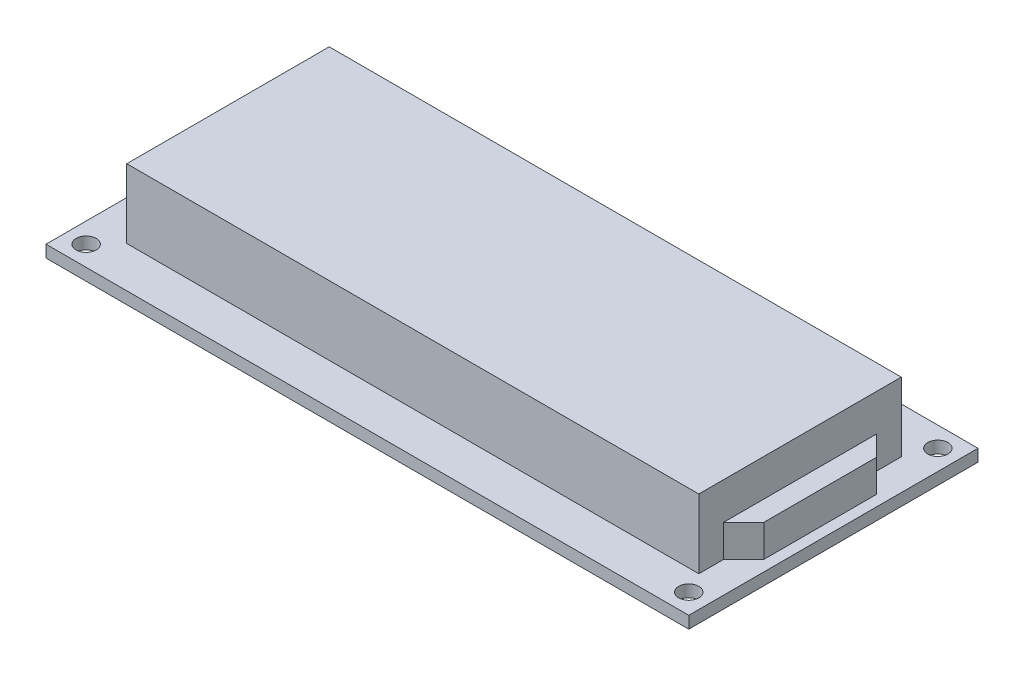
ISO-10303-21;
HEADER;
FILE_DESCRIPTION(('STEP AP214'),'2;1');
FILE_NAME('part.step','',(''),(''),'','','');
FILE_SCHEMA(('AUTOMOTIVE_DESIGN { 1 0 10303 214 1 1 1 1 }'));
ENDSEC;
DATA;
#1=APPLICATION_CONTEXT('core data for automotive mechanical design processes');
#2=APPLICATION_PROTOCOL_DEFINITION('international standard','automotive_design',2000,#1);
#3=PRODUCT_CONTEXT('',#1,'mechanical');
#4=PRODUCT('Part','Part','',(#3));
#5=PRODUCT_RELATED_PRODUCT_CATEGORY('part','',(#4));
#6=PRODUCT_DEFINITION_FORMATION('','',#4);
#7=PRODUCT_DEFINITION_CONTEXT('part definition',#1,'design');
#8=PRODUCT_DEFINITION('design','',#6,#7);
#9=PRODUCT_DEFINITION_SHAPE('','',#8);
#10=(LENGTH_UNIT() NAMED_UNIT(*) SI_UNIT(.MILLI.,.METRE.));
#11=(NAMED_UNIT(*) PLANE_ANGLE_UNIT() SI_UNIT($,.RADIAN.));
#12=(NAMED_UNIT(*) SI_UNIT($,.STERADIAN.) SOLID_ANGLE_UNIT());
#13=UNCERTAINTY_MEASURE_WITH_UNIT(LENGTH_MEASURE(1.E-05),#10,'distance_accuracy_value','');
#14=(GEOMETRIC_REPRESENTATION_CONTEXT(3) GLOBAL_UNCERTAINTY_ASSIGNED_CONTEXT((#13)) GLOBAL_UNIT_ASSIGNED_CONTEXT((#10,
#11,#12)) REPRESENTATION_CONTEXT('',''));
#15=CARTESIAN_POINT('',(0.,0.,0.));
#16=DIRECTION('',(0.,0.,1.));
#17=DIRECTION('',(1.,0.,0.));
#18=AXIS2_PLACEMENT_3D('',#15,#16,#17);
#19=CARTESIAN_POINT('',(0.,0.,0.));
#20=DIRECTION('',(0.,1.,0.));
#21=DIRECTION('',(0.,0.,1.));
#22=AXIS2_PLACEMENT_3D('',#19,#20,#21);
#23=PLANE('',#22);
#24=DIRECTION('',(0.,0.,1.));
#25=VECTOR('',#24,1.);
#26=CARTESIAN_POINT('',(-40.,0.,18.));
#27=LINE('',#26,#25);
#28=CARTESIAN_POINT('',(-40.,0.,-18.));
#29=VERTEX_POINT('',#28);
#30=CARTESIAN_POINT('',(-40.,0.,18.));
#31=VERTEX_POINT('',#30);
#32=EDGE_CURVE('E264',#29,#31,#27,.T.);
#33=ORIENTED_EDGE('',*,*,#32,.F.);
#34=DIRECTION('',(-1.,0.,0.));
#35=VECTOR('',#34,1.);
#36=CARTESIAN_POINT('',(40.,0.,-18.));
#37=LINE('',#36,#35);
#38=CARTESIAN_POINT('',(40.,0.,-18.));
#39=VERTEX_POINT('',#38);
#40=EDGE_CURVE('E271',#39,#29,#37,.T.);
#41=ORIENTED_EDGE('',*,*,#40,.F.);
#42=DIRECTION('',(0.,0.,-1.));
#43=VECTOR('',#42,1.);
#44=CARTESIAN_POINT('',(40.,0.,18.));
#45=LINE('',#44,#43);
#46=CARTESIAN_POINT('',(40.,0.,18.));
#47=VERTEX_POINT('',#46);
#48=EDGE_CURVE('E282',#47,#39,#45,.T.);
#49=ORIENTED_EDGE('',*,*,#48,.F.);
#50=DIRECTION('',(1.,0.,0.));
#51=VECTOR('',#50,1.);
#52=CARTESIAN_POINT('',(40.,0.,18.));
#53=LINE('',#52,#51);
#54=EDGE_CURVE('E280',#31,#47,#53,.T.);
#55=ORIENTED_EDGE('',*,*,#54,.F.);
#56=EDGE_LOOP('',(#33,#41,#49,#55));
#57=FACE_BOUND('',#56,.T.);
#58=CARTESIAN_POINT('',(-37.5,0.,-15.5));
#59=DIRECTION('',(0.,1.,0.));
#60=DIRECTION('',(0.,0.,1.));
#61=AXIS2_PLACEMENT_3D('',#58,#59,#60);
#62=CIRCLE('',#61,1.25000000000001);
#63=CARTESIAN_POINT('',(-37.5,0.,-14.25));
#64=VERTEX_POINT('',#63);
#65=EDGE_CURVE('E261',#64,#64,#62,.T.);
#66=ORIENTED_EDGE('',*,*,#65,.T.);
#67=EDGE_LOOP('',(#66));
#68=FACE_BOUND('',#67,.T.);
#69=CARTESIAN_POINT('',(37.5,0.,-15.5));
#70=DIRECTION('',(0.,1.,0.));
#71=DIRECTION('',(0.,0.,1.));
#72=AXIS2_PLACEMENT_3D('',#69,#70,#71);
#73=CIRCLE('',#72,1.25);
#74=CARTESIAN_POINT('',(37.5,0.,-14.25));
#75=VERTEX_POINT('',#74);
#76=EDGE_CURVE('E255',#75,#75,#73,.T.);
#77=ORIENTED_EDGE('',*,*,#76,.T.);
#78=EDGE_LOOP('',(#77));
#79=FACE_BOUND('',#78,.T.);
#80=CARTESIAN_POINT('',(-37.5,0.,15.5));
#81=DIRECTION('',(0.,1.,0.));
#82=DIRECTION('',(0.,0.,1.));
#83=AXIS2_PLACEMENT_3D('',#80,#81,#82);
#84=CIRCLE('',#83,1.25000000000001);
#85=CARTESIAN_POINT('',(-37.5,0.,16.75));
#86=VERTEX_POINT('',#85);
#87=EDGE_CURVE('E249',#86,#86,#84,.T.);
#88=ORIENTED_EDGE('',*,*,#87,.T.);
#89=EDGE_LOOP('',(#88));
#90=FACE_BOUND('',#89,.T.);
#91=CARTESIAN_POINT('',(37.5,0.,15.5));
#92=DIRECTION('',(0.,1.,0.));
#93=DIRECTION('',(0.,0.,1.));
#94=AXIS2_PLACEMENT_3D('',#91,#92,#93);
#95=CIRCLE('',#94,1.25000000000001);
#96=CARTESIAN_POINT('',(37.5,0.,16.75));
#97=VERTEX_POINT('',#96);
#98=EDGE_CURVE('E243',#97,#97,#95,.T.);
#99=ORIENTED_EDGE('',*,*,#98,.T.);
#100=EDGE_LOOP('',(#99));
#101=FACE_BOUND('',#100,.T.);
#102=DIRECTION('',(0.,0.,-1.));
#103=VECTOR('',#102,1.);
#104=CARTESIAN_POINT('',(-33.,0.,-17.5));
#105=LINE('',#104,#103);
#106=CARTESIAN_POINT('',(-33.,0.,-14.96));
#107=VERTEX_POINT('',#106);
#108=CARTESIAN_POINT('',(-33.,0.,-17.5));
#109=VERTEX_POINT('',#108);
#110=EDGE_CURVE('E172',#107,#109,#105,.T.);
#111=ORIENTED_EDGE('',*,*,#110,.F.);
#112=DIRECTION('',(-1.,0.,0.));
#113=VECTOR('',#112,1.);
#114=CARTESIAN_POINT('',(-33.,0.,-14.96));
#115=LINE('',#114,#113);
#116=CARTESIAN_POINT('',(8.,0.,-14.96));
#117=VERTEX_POINT('',#116);
#118=EDGE_CURVE('E169',#117,#107,#115,.T.);
#119=ORIENTED_EDGE('',*,*,#118,.F.);
#120=DIRECTION('',(0.,0.,1.));
#121=VECTOR('',#120,1.);
#122=CARTESIAN_POINT('',(8.,0.,-17.5));
#123=LINE('',#122,#121);
#124=CARTESIAN_POINT('',(8.,0.,-17.5));
#125=VERTEX_POINT('',#124);
#126=EDGE_CURVE('E59',#125,#117,#123,.T.);
#127=ORIENTED_EDGE('',*,*,#126,.F.);
#128=DIRECTION('',(1.,0.,0.));
#129=VECTOR('',#128,1.);
#130=CARTESIAN_POINT('',(-33.,0.,-17.5));
#131=LINE('',#130,#129);
#132=EDGE_CURVE('E54',#109,#125,#131,.T.);
#133=ORIENTED_EDGE('',*,*,#132,.F.);
#134=EDGE_LOOP('',(#111,#119,#127,#133));
#135=FACE_BOUND('',#134,.T.);
#136=ADVANCED_FACE('F39',(#57,#68,#79,#90,#101,#135),#23,.F.);
#137=CARTESIAN_POINT('',(0.,1.5,0.));
#138=DIRECTION('',(0.,1.,0.));
#139=DIRECTION('',(0.,0.,1.));
#140=AXIS2_PLACEMENT_3D('',#137,#138,#139);
#141=PLANE('',#140);
#142=DIRECTION('',(0.707106781186548,0.,0.707106781186547));
#143=VECTOR('',#142,1.);
#144=CARTESIAN_POINT('',(22.675,1.5,-22.675));
#145=LINE('',#144,#143);
#146=CARTESIAN_POINT('',(36.15,1.5,-9.20000000000001));
#147=VERTEX_POINT('',#146);
#148=CARTESIAN_POINT('',(38.65,1.5,-6.70000000000001));
#149=VERTEX_POINT('',#148);
#150=EDGE_CURVE('E175',#147,#149,#145,.T.);
#151=ORIENTED_EDGE('',*,*,#150,.T.);
#152=DIRECTION('',(0.,0.,1.));
#153=VECTOR('',#152,1.);
#154=CARTESIAN_POINT('',(38.65,1.5,0.));
#155=LINE('',#154,#153);
#156=CARTESIAN_POINT('',(38.65,1.5,7.29999999999999));
#157=VERTEX_POINT('',#156);
#158=EDGE_CURVE('E173',#149,#157,#155,.T.);
#159=ORIENTED_EDGE('',*,*,#158,.T.);
#160=DIRECTION('',(0.707106781186548,0.,-0.707106781186547));
#161=VECTOR('',#160,1.);
#162=CARTESIAN_POINT('',(22.975,1.5,22.975));
#163=LINE('',#162,#161);
#164=CARTESIAN_POINT('',(36.15,1.5,9.79999999999999));
#165=VERTEX_POINT('',#164);
#166=EDGE_CURVE('E185',#165,#157,#163,.T.);
#167=ORIENTED_EDGE('',*,*,#166,.F.);
#168=DIRECTION('',(0.,0.,1.));
#169=VECTOR('',#168,1.);
#170=CARTESIAN_POINT('',(36.15,1.5,0.));
#171=LINE('',#170,#169);
#172=CARTESIAN_POINT('',(36.15,1.5,12.9));
#173=VERTEX_POINT('',#172);
#174=EDGE_CURVE('E226',#165,#173,#171,.T.);
#175=ORIENTED_EDGE('',*,*,#174,.T.);
#176=DIRECTION('',(1.,0.,0.));
#177=VECTOR('',#176,1.);
#178=CARTESIAN_POINT('',(0.,1.5,12.9));
#179=LINE('',#178,#177);
#180=CARTESIAN_POINT('',(-35.05,1.5,12.9));
#181=VERTEX_POINT('',#180);
#182=EDGE_CURVE('E223',#181,#173,#179,.T.);
#183=ORIENTED_EDGE('',*,*,#182,.F.);
#184=DIRECTION('',(0.,0.,1.));
#185=VECTOR('',#184,1.);
#186=CARTESIAN_POINT('',(-35.05,1.5,0.));
#187=LINE('',#186,#185);
#188=CARTESIAN_POINT('',(-35.05,1.5,-12.3));
#189=VERTEX_POINT('',#188);
#190=EDGE_CURVE('E207',#189,#181,#187,.T.);
#191=ORIENTED_EDGE('',*,*,#190,.F.);
#192=DIRECTION('',(1.,0.,0.));
#193=VECTOR('',#192,1.);
#194=CARTESIAN_POINT('',(0.,1.5,-12.3));
#195=LINE('',#194,#193);
#196=CARTESIAN_POINT('',(36.15,1.5,-12.3));
#197=VERTEX_POINT('',#196);
#198=EDGE_CURVE('E212',#189,#197,#195,.T.);
#199=ORIENTED_EDGE('',*,*,#198,.T.);
#200=EDGE_CURVE('E227',#197,#147,#171,.T.);
#201=ORIENTED_EDGE('',*,*,#200,.T.);
#202=EDGE_LOOP('',(#151,#159,#167,#175,#183,#191,#199,#201));
#203=FACE_BOUND('',#202,.T.);
#204=DIRECTION('',(0.,0.,1.));
#205=VECTOR('',#204,1.);
#206=CARTESIAN_POINT('',(-40.,1.5,18.));
#207=LINE('',#206,#205);
#208=CARTESIAN_POINT('',(-40.,1.5,-18.));
#209=VERTEX_POINT('',#208);
#210=CARTESIAN_POINT('',(-40.,1.5,18.));
#211=VERTEX_POINT('',#210);
#212=EDGE_CURVE('E267',#209,#211,#207,.T.);
#213=ORIENTED_EDGE('',*,*,#212,.T.);
#214=DIRECTION('',(1.,0.,0.));
#215=VECTOR('',#214,1.);
#216=CARTESIAN_POINT('',(40.,1.5,18.));
#217=LINE('',#216,#215);
#218=CARTESIAN_POINT('',(40.,1.5,18.));
#219=VERTEX_POINT('',#218);
#220=EDGE_CURVE('E270',#211,#219,#217,.T.);
#221=ORIENTED_EDGE('',*,*,#220,.T.);
#222=DIRECTION('',(0.,0.,-1.));
#223=VECTOR('',#222,1.);
#224=CARTESIAN_POINT('',(40.,1.5,18.));
#225=LINE('',#224,#223);
#226=CARTESIAN_POINT('',(40.,1.5,-18.));
#227=VERTEX_POINT('',#226);
#228=EDGE_CURVE('E273',#219,#227,#225,.T.);
#229=ORIENTED_EDGE('',*,*,#228,.T.);
#230=DIRECTION('',(-1.,0.,0.));
#231=VECTOR('',#230,1.);
#232=CARTESIAN_POINT('',(40.,1.5,-18.));
#233=LINE('',#232,#231);
#234=EDGE_CURVE('E275',#227,#209,#233,.T.);
#235=ORIENTED_EDGE('',*,*,#234,.T.);
#236=EDGE_LOOP('',(#213,#221,#229,#235));
#237=FACE_BOUND('',#236,.T.);
#238=CARTESIAN_POINT('',(-37.5,1.5,-15.5));
#239=DIRECTION('',(0.,1.,0.));
#240=DIRECTION('',(0.,0.,1.));
#241=AXIS2_PLACEMENT_3D('',#238,#239,#240);
#242=CIRCLE('',#241,1.25000000000001);
#243=CARTESIAN_POINT('',(-37.5,1.5,-14.25));
#244=VERTEX_POINT('',#243);
#245=EDGE_CURVE('E258',#244,#244,#242,.T.);
#246=ORIENTED_EDGE('',*,*,#245,.F.);
#247=EDGE_LOOP('',(#246));
#248=FACE_BOUND('',#247,.T.);
#249=CARTESIAN_POINT('',(37.5,1.5,-15.5));
#250=DIRECTION('',(0.,1.,0.));
#251=DIRECTION('',(0.,0.,1.));
#252=AXIS2_PLACEMENT_3D('',#249,#250,#251);
#253=CIRCLE('',#252,1.25);
#254=CARTESIAN_POINT('',(37.5,1.5,-14.25));
#255=VERTEX_POINT('',#254);
#256=EDGE_CURVE('E252',#255,#255,#253,.T.);
#257=ORIENTED_EDGE('',*,*,#256,.F.);
#258=EDGE_LOOP('',(#257));
#259=FACE_BOUND('',#258,.T.);
#260=CARTESIAN_POINT('',(-37.5,1.5,15.5));
#261=DIRECTION('',(0.,1.,0.));
#262=DIRECTION('',(0.,0.,1.));
#263=AXIS2_PLACEMENT_3D('',#260,#261,#262);
#264=CIRCLE('',#263,1.25000000000001);
#265=CARTESIAN_POINT('',(-37.5,1.5,16.75));
#266=VERTEX_POINT('',#265);
#267=EDGE_CURVE('E246',#266,#266,#264,.T.);
#268=ORIENTED_EDGE('',*,*,#267,.F.);
#269=EDGE_LOOP('',(#268));
#270=FACE_BOUND('',#269,.T.);
#271=CARTESIAN_POINT('',(37.5,1.5,15.5));
#272=DIRECTION('',(0.,1.,0.));
#273=DIRECTION('',(0.,0.,1.));
#274=AXIS2_PLACEMENT_3D('',#271,#272,#273);
#275=CIRCLE('',#274,1.25000000000001);
#276=CARTESIAN_POINT('',(37.5,1.5,16.75));
#277=VERTEX_POINT('',#276);
#278=EDGE_CURVE('E242',#277,#277,#275,.T.);
#279=ORIENTED_EDGE('',*,*,#278,.F.);
#280=EDGE_LOOP('',(#279));
#281=FACE_BOUND('',#280,.T.);
#282=ADVANCED_FACE('F309',(#203,#237,#248,#259,#270,#281),#141,.T.);
#283=CARTESIAN_POINT('',(-40.,1.5,18.));
#284=DIRECTION('',(1.,0.,0.));
#285=DIRECTION('',(0.,0.,-1.));
#286=AXIS2_PLACEMENT_3D('',#283,#284,#285);
#287=PLANE('',#286);
#288=ORIENTED_EDGE('',*,*,#32,.T.);
#289=DIRECTION('',(0.,-1.,0.));
#290=VECTOR('',#289,1.);
#291=CARTESIAN_POINT('',(-40.,1.5,18.));
#292=LINE('',#291,#290);
#293=EDGE_CURVE('E11',#211,#31,#292,.T.);
#294=ORIENTED_EDGE('',*,*,#293,.F.);
#295=ORIENTED_EDGE('',*,*,#212,.F.);
#296=DIRECTION('',(0.,-1.,0.));
#297=VECTOR('',#296,1.);
#298=CARTESIAN_POINT('',(-40.,1.5,-18.));
#299=LINE('',#298,#297);
#300=EDGE_CURVE('E277',#209,#29,#299,.T.);
#301=ORIENTED_EDGE('',*,*,#300,.T.);
#302=EDGE_LOOP('',(#288,#294,#295,#301));
#303=FACE_BOUND('',#302,.T.);
#304=ADVANCED_FACE('F41',(#303),#287,.F.);
#305=CARTESIAN_POINT('',(40.,1.5,18.));
#306=DIRECTION('',(0.,0.,-1.));
#307=DIRECTION('',(-1.,0.,0.));
#308=AXIS2_PLACEMENT_3D('',#305,#306,#307);
#309=PLANE('',#308);
#310=ORIENTED_EDGE('',*,*,#54,.T.);
#311=DIRECTION('',(0.,-1.,0.));
#312=VECTOR('',#311,1.);
#313=CARTESIAN_POINT('',(40.,1.5,18.));
#314=LINE('',#313,#312);
#315=EDGE_CURVE('E47',#219,#47,#314,.T.);
#316=ORIENTED_EDGE('',*,*,#315,.F.);
#317=ORIENTED_EDGE('',*,*,#220,.F.);
#318=ORIENTED_EDGE('',*,*,#293,.T.);
#319=EDGE_LOOP('',(#310,#316,#317,#318));
#320=FACE_BOUND('',#319,.T.);
#321=ADVANCED_FACE('F311',(#320),#309,.F.);
#322=CARTESIAN_POINT('',(40.,1.5,18.));
#323=DIRECTION('',(-1.,0.,0.));
#324=DIRECTION('',(0.,0.,1.));
#325=AXIS2_PLACEMENT_3D('',#322,#323,#324);
#326=PLANE('',#325);
#327=ORIENTED_EDGE('',*,*,#48,.T.);
#328=DIRECTION('',(0.,-1.,0.));
#329=VECTOR('',#328,1.);
#330=CARTESIAN_POINT('',(40.,1.5,-18.));
#331=LINE('',#330,#329);
#332=EDGE_CURVE('E287',#227,#39,#331,.T.);
#333=ORIENTED_EDGE('',*,*,#332,.F.);
#334=ORIENTED_EDGE('',*,*,#228,.F.);
#335=ORIENTED_EDGE('',*,*,#315,.T.);
#336=EDGE_LOOP('',(#327,#333,#334,#335));
#337=FACE_BOUND('',#336,.T.);
#338=ADVANCED_FACE('F294',(#337),#326,.F.);
#339=CARTESIAN_POINT('',(40.,1.5,-18.));
#340=DIRECTION('',(0.,0.,1.));
#341=DIRECTION('',(1.,0.,0.));
#342=AXIS2_PLACEMENT_3D('',#339,#340,#341);
#343=PLANE('',#342);
#344=ORIENTED_EDGE('',*,*,#40,.T.);
#345=ORIENTED_EDGE('',*,*,#300,.F.);
#346=ORIENTED_EDGE('',*,*,#234,.F.);
#347=ORIENTED_EDGE('',*,*,#332,.T.);
#348=EDGE_LOOP('',(#344,#345,#346,#347));
#349=FACE_BOUND('',#348,.T.);
#350=ADVANCED_FACE('F303',(#349),#343,.F.);
#351=CARTESIAN_POINT('',(-37.5,0.,-15.5));
#352=DIRECTION('',(0.,1.,0.));
#353=DIRECTION('',(0.,0.,1.));
#354=AXIS2_PLACEMENT_3D('',#351,#352,#353);
#355=CYLINDRICAL_SURFACE('',#354,1.25000000000001);
#356=ORIENTED_EDGE('',*,*,#65,.F.);
#357=EDGE_LOOP('',(#356));
#358=FACE_BOUND('',#357,.T.);
#359=ORIENTED_EDGE('',*,*,#245,.T.);
#360=EDGE_LOOP('',(#359));
#361=FACE_BOUND('',#360,.T.);
#362=ADVANCED_FACE('F328',(#358,#361),#355,.F.);
#363=CARTESIAN_POINT('',(37.5,0.,-15.5));
#364=DIRECTION('',(0.,1.,0.));
#365=DIRECTION('',(0.,0.,1.));
#366=AXIS2_PLACEMENT_3D('',#363,#364,#365);
#367=CYLINDRICAL_SURFACE('',#366,1.25);
#368=ORIENTED_EDGE('',*,*,#76,.F.);
#369=EDGE_LOOP('',(#368));
#370=FACE_BOUND('',#369,.T.);
#371=ORIENTED_EDGE('',*,*,#256,.T.);
#372=EDGE_LOOP('',(#371));
#373=FACE_BOUND('',#372,.T.);
#374=ADVANCED_FACE('F332',(#370,#373),#367,.F.);
#375=CARTESIAN_POINT('',(-37.5,0.,15.5));
#376=DIRECTION('',(0.,1.,0.));
#377=DIRECTION('',(0.,0.,1.));
#378=AXIS2_PLACEMENT_3D('',#375,#376,#377);
#379=CYLINDRICAL_SURFACE('',#378,1.25000000000001);
#380=ORIENTED_EDGE('',*,*,#87,.F.);
#381=EDGE_LOOP('',(#380));
#382=FACE_BOUND('',#381,.T.);
#383=ORIENTED_EDGE('',*,*,#267,.T.);
#384=EDGE_LOOP('',(#383));
#385=FACE_BOUND('',#384,.T.);
#386=ADVANCED_FACE('F337',(#382,#385),#379,.F.);
#387=CARTESIAN_POINT('',(37.5,0.,15.5));
#388=DIRECTION('',(0.,1.,0.));
#389=DIRECTION('',(0.,0.,1.));
#390=AXIS2_PLACEMENT_3D('',#387,#388,#389);
#391=CYLINDRICAL_SURFACE('',#390,1.25000000000001);
#392=ORIENTED_EDGE('',*,*,#98,.F.);
#393=EDGE_LOOP('',(#392));
#394=FACE_BOUND('',#393,.T.);
#395=ORIENTED_EDGE('',*,*,#278,.T.);
#396=EDGE_LOOP('',(#395));
#397=FACE_BOUND('',#396,.T.);
#398=ADVANCED_FACE('F345',(#394,#397),#391,.F.);
#399=CARTESIAN_POINT('',(-35.05,10.1,0.));
#400=DIRECTION('',(1.,0.,0.));
#401=DIRECTION('',(0.,0.,-1.));
#402=AXIS2_PLACEMENT_3D('',#399,#400,#401);
#403=PLANE('',#402);
#404=ORIENTED_EDGE('',*,*,#190,.T.);
#405=DIRECTION('',(0.,-1.,0.));
#406=VECTOR('',#405,1.);
#407=CARTESIAN_POINT('',(-35.05,10.1,12.9));
#408=LINE('',#407,#406);
#409=CARTESIAN_POINT('',(-35.05,10.1,12.9));
#410=VERTEX_POINT('',#409);
#411=EDGE_CURVE('E239',#410,#181,#408,.T.);
#412=ORIENTED_EDGE('',*,*,#411,.F.);
#413=DIRECTION('',(0.,0.,1.));
#414=VECTOR('',#413,1.);
#415=CARTESIAN_POINT('',(-35.05,10.1,0.));
#416=LINE('',#415,#414);
#417=CARTESIAN_POINT('',(-35.05,10.1,-12.3));
#418=VERTEX_POINT('',#417);
#419=EDGE_CURVE('E208',#418,#410,#416,.T.);
#420=ORIENTED_EDGE('',*,*,#419,.F.);
#421=DIRECTION('',(0.,-1.,0.));
#422=VECTOR('',#421,1.);
#423=CARTESIAN_POINT('',(-35.05,10.1,-12.3));
#424=LINE('',#423,#422);
#425=EDGE_CURVE('E220',#418,#189,#424,.T.);
#426=ORIENTED_EDGE('',*,*,#425,.T.);
#427=EDGE_LOOP('',(#404,#412,#420,#426));
#428=FACE_BOUND('',#427,.T.);
#429=ADVANCED_FACE('F349',(#428),#403,.F.);
#430=CARTESIAN_POINT('',(0.,10.1,12.9));
#431=DIRECTION('',(0.,0.,-1.));
#432=DIRECTION('',(-1.,0.,0.));
#433=AXIS2_PLACEMENT_3D('',#430,#431,#432);
#434=PLANE('',#433);
#435=ORIENTED_EDGE('',*,*,#182,.T.);
#436=DIRECTION('',(0.,-1.,0.));
#437=VECTOR('',#436,1.);
#438=CARTESIAN_POINT('',(36.15,10.1,12.9));
#439=LINE('',#438,#437);
#440=CARTESIAN_POINT('',(36.15,10.1,12.9));
#441=VERTEX_POINT('',#440);
#442=EDGE_CURVE('E236',#441,#173,#439,.T.);
#443=ORIENTED_EDGE('',*,*,#442,.F.);
#444=DIRECTION('',(1.,0.,0.));
#445=VECTOR('',#444,1.);
#446=CARTESIAN_POINT('',(0.,10.1,12.9));
#447=LINE('',#446,#445);
#448=EDGE_CURVE('E211',#410,#441,#447,.T.);
#449=ORIENTED_EDGE('',*,*,#448,.F.);
#450=ORIENTED_EDGE('',*,*,#411,.T.);
#451=EDGE_LOOP('',(#435,#443,#449,#450));
#452=FACE_BOUND('',#451,.T.);
#453=ADVANCED_FACE('F353',(#452),#434,.F.);
#454=CARTESIAN_POINT('',(36.15,10.1,0.));
#455=DIRECTION('',(1.,0.,0.));
#456=DIRECTION('',(0.,0.,-1.));
#457=AXIS2_PLACEMENT_3D('',#454,#455,#456);
#458=PLANE('',#457);
#459=DIRECTION('',(0.,-1.,0.));
#460=VECTOR('',#459,1.);
#461=CARTESIAN_POINT('',(36.15,5.5,-9.20000000000001));
#462=LINE('',#461,#460);
#463=CARTESIAN_POINT('',(36.15,5.5,-9.20000000000001));
#464=VERTEX_POINT('',#463);
#465=EDGE_CURVE('E202',#464,#147,#462,.T.);
#466=ORIENTED_EDGE('',*,*,#465,.T.);
#467=ORIENTED_EDGE('',*,*,#200,.F.);
#468=DIRECTION('',(0.,-1.,0.));
#469=VECTOR('',#468,1.);
#470=CARTESIAN_POINT('',(36.15,10.1,-12.3));
#471=LINE('',#470,#469);
#472=CARTESIAN_POINT('',(36.15,10.1,-12.3));
#473=VERTEX_POINT('',#472);
#474=EDGE_CURVE('E233',#473,#197,#471,.T.);
#475=ORIENTED_EDGE('',*,*,#474,.F.);
#476=DIRECTION('',(0.,0.,1.));
#477=VECTOR('',#476,1.);
#478=CARTESIAN_POINT('',(36.15,10.1,0.));
#479=LINE('',#478,#477);
#480=EDGE_CURVE('E214',#473,#441,#479,.T.);
#481=ORIENTED_EDGE('',*,*,#480,.T.);
#482=ORIENTED_EDGE('',*,*,#442,.T.);
#483=ORIENTED_EDGE('',*,*,#174,.F.);
#484=DIRECTION('',(0.,-1.,0.));
#485=VECTOR('',#484,1.);
#486=CARTESIAN_POINT('',(36.15,5.5,9.79999999999999));
#487=LINE('',#486,#485);
#488=CARTESIAN_POINT('',(36.15,5.5,9.79999999999999));
#489=VERTEX_POINT('',#488);
#490=EDGE_CURVE('E199',#489,#165,#487,.T.);
#491=ORIENTED_EDGE('',*,*,#490,.F.);
#492=DIRECTION('',(0.,0.,1.));
#493=VECTOR('',#492,1.);
#494=CARTESIAN_POINT('',(36.15,5.5,0.));
#495=LINE('',#494,#493);
#496=EDGE_CURVE('E188',#464,#489,#495,.T.);
#497=ORIENTED_EDGE('',*,*,#496,.F.);
#498=EDGE_LOOP('',(#466,#467,#475,#481,#482,#483,#491,#497));
#499=FACE_BOUND('',#498,.T.);
#500=ADVANCED_FACE('F357',(#499),#458,.T.);
#501=CARTESIAN_POINT('',(0.,10.1,-12.3));
#502=DIRECTION('',(0.,0.,-1.));
#503=DIRECTION('',(-1.,0.,0.));
#504=AXIS2_PLACEMENT_3D('',#501,#502,#503);
#505=PLANE('',#504);
#506=ORIENTED_EDGE('',*,*,#198,.F.);
#507=ORIENTED_EDGE('',*,*,#425,.F.);
#508=DIRECTION('',(1.,0.,0.));
#509=VECTOR('',#508,1.);
#510=CARTESIAN_POINT('',(0.,10.1,-12.3));
#511=LINE('',#510,#509);
#512=EDGE_CURVE('E217',#418,#473,#511,.T.);
#513=ORIENTED_EDGE('',*,*,#512,.T.);
#514=ORIENTED_EDGE('',*,*,#474,.T.);
#515=EDGE_LOOP('',(#506,#507,#513,#514));
#516=FACE_BOUND('',#515,.T.);
#517=ADVANCED_FACE('F361',(#516),#505,.T.);
#518=CARTESIAN_POINT('',(0.,10.1,0.));
#519=DIRECTION('',(0.,1.,0.));
#520=DIRECTION('',(0.,0.,1.));
#521=AXIS2_PLACEMENT_3D('',#518,#519,#520);
#522=PLANE('',#521);
#523=ORIENTED_EDGE('',*,*,#419,.T.);
#524=ORIENTED_EDGE('',*,*,#448,.T.);
#525=ORIENTED_EDGE('',*,*,#480,.F.);
#526=ORIENTED_EDGE('',*,*,#512,.F.);
#527=EDGE_LOOP('',(#523,#524,#525,#526));
#528=FACE_BOUND('',#527,.T.);
#529=ADVANCED_FACE('F365',(#528),#522,.T.);
#530=CARTESIAN_POINT('',(38.65,5.5,0.));
#531=DIRECTION('',(1.,0.,0.));
#532=DIRECTION('',(0.,0.,-1.));
#533=AXIS2_PLACEMENT_3D('',#530,#531,#532);
#534=PLANE('',#533);
#535=ORIENTED_EDGE('',*,*,#158,.F.);
#536=DIRECTION('',(0.,-1.,0.));
#537=VECTOR('',#536,1.);
#538=CARTESIAN_POINT('',(38.65,5.5,-6.70000000000001));
#539=LINE('',#538,#537);
#540=CARTESIAN_POINT('',(38.65,5.5,-6.70000000000001));
#541=VERTEX_POINT('',#540);
#542=EDGE_CURVE('E204',#541,#149,#539,.T.);
#543=ORIENTED_EDGE('',*,*,#542,.F.);
#544=DIRECTION('',(0.,0.,1.));
#545=VECTOR('',#544,1.);
#546=CARTESIAN_POINT('',(38.65,5.5,0.));
#547=LINE('',#546,#545);
#548=CARTESIAN_POINT('',(38.65,5.5,7.29999999999999));
#549=VERTEX_POINT('',#548);
#550=EDGE_CURVE('E181',#541,#549,#547,.T.);
#551=ORIENTED_EDGE('',*,*,#550,.T.);
#552=DIRECTION('',(0.,-1.,0.));
#553=VECTOR('',#552,1.);
#554=CARTESIAN_POINT('',(38.65,5.5,7.29999999999999));
#555=LINE('',#554,#553);
#556=EDGE_CURVE('E192',#549,#157,#555,.T.);
#557=ORIENTED_EDGE('',*,*,#556,.T.);
#558=EDGE_LOOP('',(#535,#543,#551,#557));
#559=FACE_BOUND('',#558,.T.);
#560=ADVANCED_FACE('F369',(#559),#534,.T.);
#561=CARTESIAN_POINT('',(22.675,5.5,-22.675));
#562=DIRECTION('',(0.707106781186547,0.,-0.707106781186548));
#563=DIRECTION('',(-0.707106781186548,0.,-0.707106781186547));
#564=AXIS2_PLACEMENT_3D('',#561,#562,#563);
#565=PLANE('',#564);
#566=ORIENTED_EDGE('',*,*,#150,.F.);
#567=ORIENTED_EDGE('',*,*,#465,.F.);
#568=DIRECTION('',(0.707106781186548,0.,0.707106781186547));
#569=VECTOR('',#568,1.);
#570=CARTESIAN_POINT('',(22.675,5.5,-22.675));
#571=LINE('',#570,#569);
#572=EDGE_CURVE('E184',#464,#541,#571,.T.);
#573=ORIENTED_EDGE('',*,*,#572,.T.);
#574=ORIENTED_EDGE('',*,*,#542,.T.);
#575=EDGE_LOOP('',(#566,#567,#573,#574));
#576=FACE_BOUND('',#575,.T.);
#577=ADVANCED_FACE('F373',(#576),#565,.T.);
#578=CARTESIAN_POINT('',(22.975,5.5,22.975));
#579=DIRECTION('',(-0.707106781186547,0.,-0.707106781186548));
#580=DIRECTION('',(-0.707106781186548,0.,0.707106781186547));
#581=AXIS2_PLACEMENT_3D('',#578,#579,#580);
#582=PLANE('',#581);
#583=ORIENTED_EDGE('',*,*,#166,.T.);
#584=ORIENTED_EDGE('',*,*,#556,.F.);
#585=DIRECTION('',(0.707106781186548,0.,-0.707106781186547));
#586=VECTOR('',#585,1.);
#587=CARTESIAN_POINT('',(22.975,5.5,22.975));
#588=LINE('',#587,#586);
#589=EDGE_CURVE('E191',#489,#549,#588,.T.);
#590=ORIENTED_EDGE('',*,*,#589,.F.);
#591=ORIENTED_EDGE('',*,*,#490,.T.);
#592=EDGE_LOOP('',(#583,#584,#590,#591));
#593=FACE_BOUND('',#592,.T.);
#594=ADVANCED_FACE('F377',(#593),#582,.F.);
#595=CARTESIAN_POINT('',(0.,5.5,0.));
#596=DIRECTION('',(0.,1.,0.));
#597=DIRECTION('',(0.,0.,1.));
#598=AXIS2_PLACEMENT_3D('',#595,#596,#597);
#599=PLANE('',#598);
#600=ORIENTED_EDGE('',*,*,#550,.F.);
#601=ORIENTED_EDGE('',*,*,#572,.F.);
#602=ORIENTED_EDGE('',*,*,#496,.T.);
#603=ORIENTED_EDGE('',*,*,#589,.T.);
#604=EDGE_LOOP('',(#600,#601,#602,#603));
#605=FACE_BOUND('',#604,.T.);
#606=ADVANCED_FACE('F381',(#605),#599,.T.);
#607=CARTESIAN_POINT('',(-33.,-18.,-17.5));
#608=DIRECTION('',(1.,0.,0.));
#609=DIRECTION('',(0.,0.,-1.));
#610=AXIS2_PLACEMENT_3D('',#607,#608,#609);
#611=PLANE('',#610);
#612=ORIENTED_EDGE('',*,*,#110,.T.);
#613=DIRECTION('',(0.,1.,0.));
#614=VECTOR('',#613,1.);
#615=CARTESIAN_POINT('',(-33.,-18.,-17.5));
#616=LINE('',#615,#614);
#617=CARTESIAN_POINT('',(-33.,-18.,-17.5));
#618=VERTEX_POINT('',#617);
#619=EDGE_CURVE('E153',#618,#109,#616,.T.);
#620=ORIENTED_EDGE('',*,*,#619,.F.);
#621=DIRECTION('',(0.,0.,-1.));
#622=VECTOR('',#621,1.);
#623=CARTESIAN_POINT('',(-33.,-18.,-17.5));
#624=LINE('',#623,#622);
#625=CARTESIAN_POINT('',(-33.,-18.,-14.96));
#626=VERTEX_POINT('',#625);
#627=EDGE_CURVE('E160',#626,#618,#624,.T.);
#628=ORIENTED_EDGE('',*,*,#627,.F.);
#629=DIRECTION('',(0.,1.,0.));
#630=VECTOR('',#629,1.);
#631=CARTESIAN_POINT('',(-33.,-18.,-14.96));
#632=LINE('',#631,#630);
#633=EDGE_CURVE('E566',#626,#107,#632,.T.);
#634=ORIENTED_EDGE('',*,*,#633,.T.);
#635=EDGE_LOOP('',(#612,#620,#628,#634));
#636=FACE_BOUND('',#635,.T.);
#637=ADVANCED_FACE('F171',(#636),#611,.F.);
#638=CARTESIAN_POINT('',(-33.,-18.,-17.5));
#639=DIRECTION('',(0.,0.,1.));
#640=DIRECTION('',(1.,0.,0.));
#641=AXIS2_PLACEMENT_3D('',#638,#639,#640);
#642=PLANE('',#641);
#643=ORIENTED_EDGE('',*,*,#132,.T.);
#644=DIRECTION('',(0.,1.,0.));
#645=VECTOR('',#644,1.);
#646=CARTESIAN_POINT('',(8.,-18.,-17.5));
#647=LINE('',#646,#645);
#648=CARTESIAN_POINT('',(8.,-18.,-17.5));
#649=VERTEX_POINT('',#648);
#650=EDGE_CURVE('E156',#649,#125,#647,.T.);
#651=ORIENTED_EDGE('',*,*,#650,.F.);
#652=DIRECTION('',(1.,0.,0.));
#653=VECTOR('',#652,1.);
#654=CARTESIAN_POINT('',(-33.,-18.,-17.5));
#655=LINE('',#654,#653);
#656=EDGE_CURVE('E149',#618,#649,#655,.T.);
#657=ORIENTED_EDGE('',*,*,#656,.F.);
#658=ORIENTED_EDGE('',*,*,#619,.T.);
#659=EDGE_LOOP('',(#643,#651,#657,#658));
#660=FACE_BOUND('',#659,.T.);
#661=ADVANCED_FACE('F151',(#660),#642,.F.);
#662=CARTESIAN_POINT('',(8.,-18.,-17.5));
#663=DIRECTION('',(-1.,0.,0.));
#664=DIRECTION('',(0.,0.,1.));
#665=AXIS2_PLACEMENT_3D('',#662,#663,#664);
#666=PLANE('',#665);
#667=ORIENTED_EDGE('',*,*,#126,.T.);
#668=DIRECTION('',(0.,1.,0.));
#669=VECTOR('',#668,1.);
#670=CARTESIAN_POINT('',(8.,-18.,-14.96));
#671=LINE('',#670,#669);
#672=CARTESIAN_POINT('',(8.,-18.,-14.96));
#673=VERTEX_POINT('',#672);
#674=EDGE_CURVE('E177',#673,#117,#671,.T.);
#675=ORIENTED_EDGE('',*,*,#674,.F.);
#676=DIRECTION('',(0.,0.,1.));
#677=VECTOR('',#676,1.);
#678=CARTESIAN_POINT('',(8.,-18.,-17.5));
#679=LINE('',#678,#677);
#680=EDGE_CURVE('E159',#649,#673,#679,.T.);
#681=ORIENTED_EDGE('',*,*,#680,.F.);
#682=ORIENTED_EDGE('',*,*,#650,.T.);
#683=EDGE_LOOP('',(#667,#675,#681,#682));
#684=FACE_BOUND('',#683,.T.);
#685=ADVANCED_FACE('F390',(#684),#666,.F.);
#686=CARTESIAN_POINT('',(-33.,-18.,-14.96));
#687=DIRECTION('',(0.,0.,-1.));
#688=DIRECTION('',(-1.,0.,0.));
#689=AXIS2_PLACEMENT_3D('',#686,#687,#688);
#690=PLANE('',#689);
#691=ORIENTED_EDGE('',*,*,#118,.T.);
#692=ORIENTED_EDGE('',*,*,#633,.F.);
#693=DIRECTION('',(-1.,0.,0.));
#694=VECTOR('',#693,1.);
#695=CARTESIAN_POINT('',(-33.,-18.,-14.96));
#696=LINE('',#695,#694);
#697=EDGE_CURVE('E165',#673,#626,#696,.T.);
#698=ORIENTED_EDGE('',*,*,#697,.F.);
#699=ORIENTED_EDGE('',*,*,#674,.T.);
#700=EDGE_LOOP('',(#691,#692,#698,#699));
#701=FACE_BOUND('',#700,.T.);
#702=ADVANCED_FACE('F393',(#701),#690,.F.);
#703=CARTESIAN_POINT('',(0.,-18.,0.));
#704=DIRECTION('',(0.,1.,0.));
#705=DIRECTION('',(0.,0.,1.));
#706=AXIS2_PLACEMENT_3D('',#703,#704,#705);
#707=PLANE('',#706);
#708=ORIENTED_EDGE('',*,*,#627,.T.);
#709=ORIENTED_EDGE('',*,*,#656,.T.);
#710=ORIENTED_EDGE('',*,*,#680,.T.);
#711=ORIENTED_EDGE('',*,*,#697,.T.);
#712=EDGE_LOOP('',(#708,#709,#710,#711));
#713=FACE_BOUND('',#712,.T.);
#714=ADVANCED_FACE('F163',(#713),#707,.F.);
#715=CLOSED_SHELL('',(#136,#282,#304,#321,#338,#350,#362,#374,#386,#398,#429,#453,#500,#517,
#529,#560,#577,#594,#606,#637,#661,#685,#702,#714));
#716=MANIFOLD_SOLID_BREP('B2',#715);
#717=ADVANCED_BREP_SHAPE_REPRESENTATION('',(#18,#716),#14);
#718=SHAPE_DEFINITION_REPRESENTATION(#9,#717);
ENDSEC;
END-ISO-10303-21;
